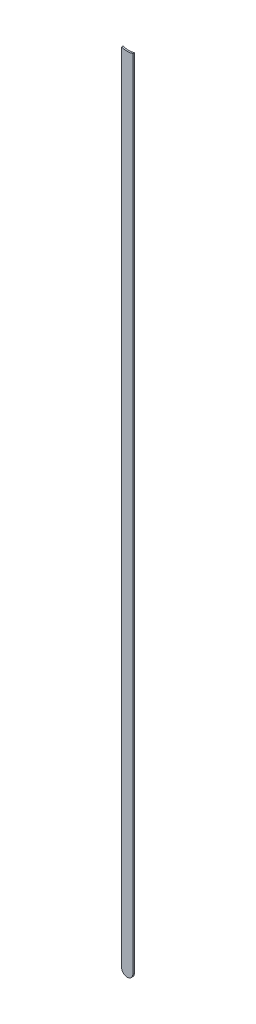
ISO-10303-21;
HEADER;
FILE_DESCRIPTION(('STEP AP214'),'2;1');
FILE_NAME('part.step','',(''),(''),'','','');
FILE_SCHEMA(('AUTOMOTIVE_DESIGN { 1 0 10303 214 1 1 1 1 }'));
ENDSEC;
DATA;
#1=APPLICATION_CONTEXT('core data for automotive mechanical design processes');
#2=APPLICATION_PROTOCOL_DEFINITION('international standard','automotive_design',2000,#1);
#3=PRODUCT_CONTEXT('',#1,'mechanical');
#4=PRODUCT('Part','Part','',(#3));
#5=PRODUCT_RELATED_PRODUCT_CATEGORY('part','',(#4));
#6=PRODUCT_DEFINITION_FORMATION('','',#4);
#7=PRODUCT_DEFINITION_CONTEXT('part definition',#1,'design');
#8=PRODUCT_DEFINITION('design','',#6,#7);
#9=PRODUCT_DEFINITION_SHAPE('','',#8);
#10=(LENGTH_UNIT() NAMED_UNIT(*) SI_UNIT(.MILLI.,.METRE.));
#11=(NAMED_UNIT(*) PLANE_ANGLE_UNIT() SI_UNIT($,.RADIAN.));
#12=(NAMED_UNIT(*) SI_UNIT($,.STERADIAN.) SOLID_ANGLE_UNIT());
#13=UNCERTAINTY_MEASURE_WITH_UNIT(LENGTH_MEASURE(1.E-05),#10,'distance_accuracy_value','');
#14=(GEOMETRIC_REPRESENTATION_CONTEXT(3) GLOBAL_UNCERTAINTY_ASSIGNED_CONTEXT((#13)) GLOBAL_UNIT_ASSIGNED_CONTEXT((#10,
#11,#12)) REPRESENTATION_CONTEXT('',''));
#15=CARTESIAN_POINT('',(0.,0.,0.));
#16=DIRECTION('',(0.,0.,1.));
#17=DIRECTION('',(1.,0.,0.));
#18=AXIS2_PLACEMENT_3D('',#15,#16,#17);
#19=CARTESIAN_POINT('',(88.74397288,55.30634608,0.));
#20=DIRECTION('',(-1.,0.,0.));
#21=DIRECTION('',(0.,1.,0.));
#22=AXIS2_PLACEMENT_3D('',#19,#20,#21);
#23=PLANE('',#22);
#24=DIRECTION('',(0.,1.,0.));
#25=VECTOR('',#24,1.);
#26=CARTESIAN_POINT('',(88.74397288,55.30634608,0.03556));
#27=LINE('',#26,#25);
#28=CARTESIAN_POINT('',(88.74397288,55.30634608,0.03556));
#29=VERTEX_POINT('',#28);
#30=CARTESIAN_POINT('',(88.74397288,73.2548243605022,0.03556));
#31=VERTEX_POINT('',#30);
#32=EDGE_CURVE('E11',#29,#31,#27,.T.);
#33=ORIENTED_EDGE('',*,*,#32,.F.);
#34=DIRECTION('',(0.,0.,1.));
#35=VECTOR('',#34,1.);
#36=CARTESIAN_POINT('',(88.74397288,55.30634608,0.));
#37=LINE('',#36,#35);
#38=CARTESIAN_POINT('',(88.74397288,55.30634608,0.));
#39=VERTEX_POINT('',#38);
#40=EDGE_CURVE('E24',#39,#29,#37,.T.);
#41=ORIENTED_EDGE('',*,*,#40,.F.);
#42=DIRECTION('',(0.,1.,0.));
#43=VECTOR('',#42,1.);
#44=CARTESIAN_POINT('',(88.74397288,55.30634608,0.));
#45=LINE('',#44,#43);
#46=CARTESIAN_POINT('',(88.74397288,73.2548243605022,0.));
#47=VERTEX_POINT('',#46);
#48=EDGE_CURVE('E75',#39,#47,#45,.T.);
#49=ORIENTED_EDGE('',*,*,#48,.T.);
#50=DIRECTION('',(0.,0.,1.));
#51=VECTOR('',#50,1.);
#52=CARTESIAN_POINT('',(88.74397288,73.2548243605022,0.));
#53=LINE('',#52,#51);
#54=EDGE_CURVE('E37',#47,#31,#53,.T.);
#55=ORIENTED_EDGE('',*,*,#54,.T.);
#56=EDGE_LOOP('',(#33,#41,#49,#55));
#57=FACE_BOUND('',#56,.T.);
#58=ADVANCED_FACE('F17',(#57),#23,.F.);
#59=CARTESIAN_POINT('',(88.61697288,73.58697246,0.));
#60=DIRECTION('',(0.,0.,-1.));
#61=DIRECTION('',(1.,0.,0.));
#62=AXIS2_PLACEMENT_3D('',#59,#60,#61);
#63=CYLINDRICAL_SURFACE('',#62,0.3556);
#64=DIRECTION('',(0.,0.,1.));
#65=VECTOR('',#64,1.);
#66=CARTESIAN_POINT('',(88.48997288,73.2548243605022,0.));
#67=LINE('',#66,#65);
#68=CARTESIAN_POINT('',(88.48997288,73.2548243605022,0.));
#69=VERTEX_POINT('',#68);
#70=CARTESIAN_POINT('',(88.48997288,73.2548243605022,0.03556));
#71=VERTEX_POINT('',#70);
#72=EDGE_CURVE('E67',#69,#71,#67,.T.);
#73=ORIENTED_EDGE('',*,*,#72,.T.);
#74=CARTESIAN_POINT('',(88.61697288,73.58697246,0.03556));
#75=DIRECTION('',(0.,0.,1.));
#76=DIRECTION('',(1.,0.,0.));
#77=AXIS2_PLACEMENT_3D('',#74,#75,#76);
#78=CIRCLE('',#77,0.3556);
#79=EDGE_CURVE('E82',#71,#31,#78,.T.);
#80=ORIENTED_EDGE('',*,*,#79,.T.);
#81=ORIENTED_EDGE('',*,*,#54,.F.);
#82=CARTESIAN_POINT('',(88.61697288,73.58697246,0.));
#83=DIRECTION('',(0.,0.,1.));
#84=DIRECTION('',(1.,0.,0.));
#85=AXIS2_PLACEMENT_3D('',#82,#83,#84);
#86=CIRCLE('',#85,0.3556);
#87=EDGE_CURVE('E80',#69,#47,#86,.T.);
#88=ORIENTED_EDGE('',*,*,#87,.F.);
#89=EDGE_LOOP('',(#73,#80,#81,#88));
#90=FACE_BOUND('',#89,.T.);
#91=ADVANCED_FACE('F88',(#90),#63,.F.);
#92=CARTESIAN_POINT('',(88.48997288,73.2548243605022,0.));
#93=DIRECTION('',(1.,0.,0.));
#94=DIRECTION('',(0.,-1.,0.));
#95=AXIS2_PLACEMENT_3D('',#92,#93,#94);
#96=PLANE('',#95);
#97=DIRECTION('',(0.,-1.,0.));
#98=VECTOR('',#97,1.);
#99=CARTESIAN_POINT('',(88.48997288,73.58697246,0.03556));
#100=LINE('',#99,#98);
#101=CARTESIAN_POINT('',(88.48997288,55.30634608,0.03556));
#102=VERTEX_POINT('',#101);
#103=EDGE_CURVE('E71',#71,#102,#100,.T.);
#104=ORIENTED_EDGE('',*,*,#103,.F.);
#105=ORIENTED_EDGE('',*,*,#72,.F.);
#106=DIRECTION('',(0.,-1.,0.));
#107=VECTOR('',#106,1.);
#108=CARTESIAN_POINT('',(88.48997288,73.58697246,0.));
#109=LINE('',#108,#107);
#110=CARTESIAN_POINT('',(88.48997288,55.30634608,0.));
#111=VERTEX_POINT('',#110);
#112=EDGE_CURVE('E63',#69,#111,#109,.T.);
#113=ORIENTED_EDGE('',*,*,#112,.T.);
#114=DIRECTION('',(0.,0.,1.));
#115=VECTOR('',#114,1.);
#116=CARTESIAN_POINT('',(88.48997288,55.30634608,0.));
#117=LINE('',#116,#115);
#118=EDGE_CURVE('E53',#111,#102,#117,.T.);
#119=ORIENTED_EDGE('',*,*,#118,.T.);
#120=EDGE_LOOP('',(#104,#105,#113,#119));
#121=FACE_BOUND('',#120,.T.);
#122=ADVANCED_FACE('F66',(#121),#96,.F.);
#123=CARTESIAN_POINT('',(88.61697288,55.30634608,0.));
#124=DIRECTION('',(0.,0.,-1.));
#125=DIRECTION('',(-1.,0.,0.));
#126=AXIS2_PLACEMENT_3D('',#123,#124,#125);
#127=CYLINDRICAL_SURFACE('',#126,0.126999999999998);
#128=CARTESIAN_POINT('',(88.61697288,55.30634608,0.03556));
#129=DIRECTION('',(0.,0.,1.));
#130=DIRECTION('',(-1.,0.,0.));
#131=AXIS2_PLACEMENT_3D('',#128,#129,#130);
#132=CIRCLE('',#131,0.126999999999998);
#133=EDGE_CURVE('E59',#102,#29,#132,.T.);
#134=ORIENTED_EDGE('',*,*,#133,.F.);
#135=ORIENTED_EDGE('',*,*,#118,.F.);
#136=CARTESIAN_POINT('',(88.61697288,55.30634608,0.));
#137=DIRECTION('',(0.,0.,1.));
#138=DIRECTION('',(-1.,0.,0.));
#139=AXIS2_PLACEMENT_3D('',#136,#137,#138);
#140=CIRCLE('',#139,0.126999999999998);
#141=EDGE_CURVE('E57',#111,#39,#140,.T.);
#142=ORIENTED_EDGE('',*,*,#141,.T.);
#143=ORIENTED_EDGE('',*,*,#40,.T.);
#144=EDGE_LOOP('',(#134,#135,#142,#143));
#145=FACE_BOUND('',#144,.T.);
#146=ADVANCED_FACE('F55',(#145),#127,.T.);
#147=CARTESIAN_POINT('',(88.74397288,55.30634608,0.));
#148=DIRECTION('',(0.,0.,-1.));
#149=DIRECTION('',(-1.,0.,0.));
#150=AXIS2_PLACEMENT_3D('',#147,#148,#149);
#151=PLANE('',#150);
#152=ORIENTED_EDGE('',*,*,#48,.F.);
#153=ORIENTED_EDGE('',*,*,#141,.F.);
#154=ORIENTED_EDGE('',*,*,#112,.F.);
#155=ORIENTED_EDGE('',*,*,#87,.T.);
#156=EDGE_LOOP('',(#152,#153,#154,#155));
#157=FACE_BOUND('',#156,.T.);
#158=ADVANCED_FACE('F74',(#157),#151,.T.);
#159=CARTESIAN_POINT('',(88.74397288,55.30634608,0.03556));
#160=DIRECTION('',(0.,0.,-1.));
#161=DIRECTION('',(-1.,0.,0.));
#162=AXIS2_PLACEMENT_3D('',#159,#160,#161);
#163=PLANE('',#162);
#164=ORIENTED_EDGE('',*,*,#133,.T.);
#165=ORIENTED_EDGE('',*,*,#32,.T.);
#166=ORIENTED_EDGE('',*,*,#79,.F.);
#167=ORIENTED_EDGE('',*,*,#103,.T.);
#168=EDGE_LOOP('',(#164,#165,#166,#167));
#169=FACE_BOUND('',#168,.T.);
#170=ADVANCED_FACE('F91',(#169),#163,.F.);
#171=CLOSED_SHELL('',(#58,#91,#122,#146,#158,#170));
#172=MANIFOLD_SOLID_BREP('B1',#171);
#173=ADVANCED_BREP_SHAPE_REPRESENTATION('',(#18,#172),#14);
#174=SHAPE_DEFINITION_REPRESENTATION(#9,#173);
ENDSEC;
END-ISO-10303-21;
